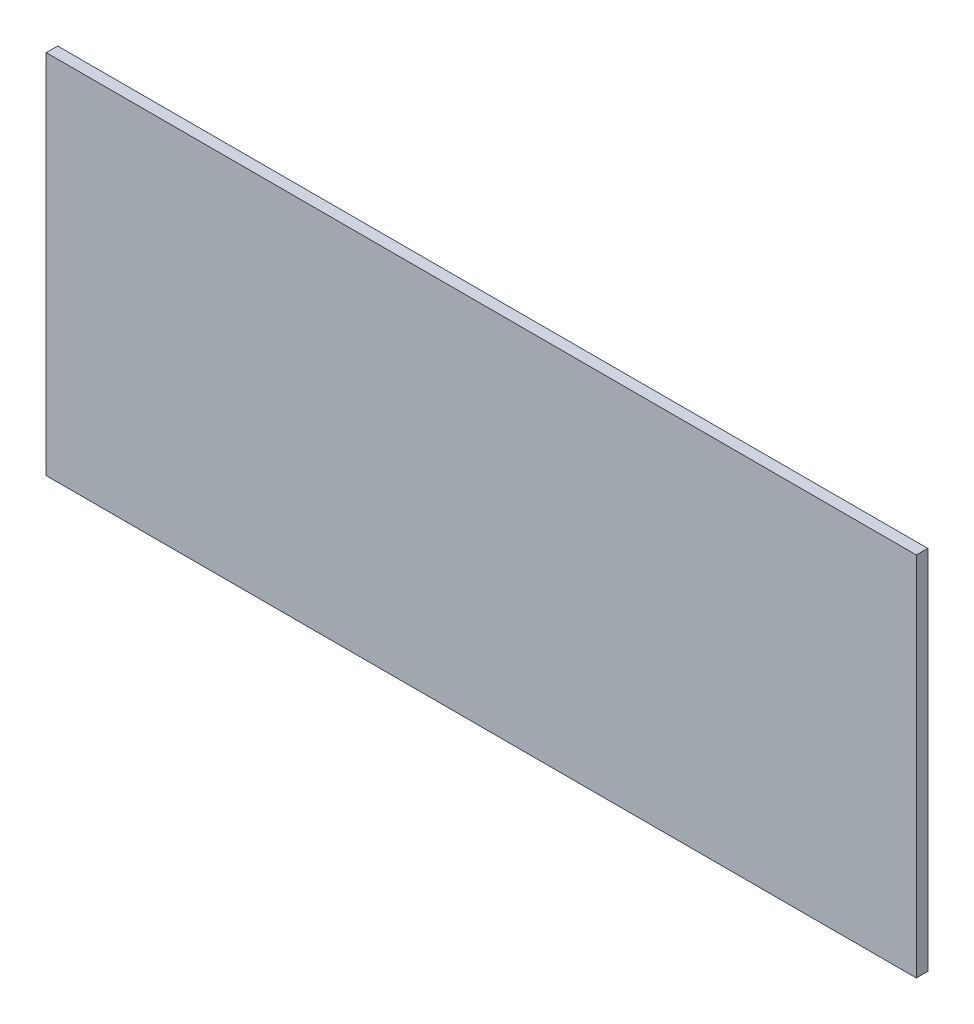
ISO-10303-21;
HEADER;
FILE_DESCRIPTION(('STEP AP214'),'2;1');
FILE_NAME('part.step','',(''),(''),'','','');
FILE_SCHEMA(('AUTOMOTIVE_DESIGN { 1 0 10303 214 1 1 1 1 }'));
ENDSEC;
DATA;
#1=APPLICATION_CONTEXT('core data for automotive mechanical design processes');
#2=APPLICATION_PROTOCOL_DEFINITION('international standard','automotive_design',2000,#1);
#3=PRODUCT_CONTEXT('',#1,'mechanical');
#4=PRODUCT('Part','Part','',(#3));
#5=PRODUCT_RELATED_PRODUCT_CATEGORY('part','',(#4));
#6=PRODUCT_DEFINITION_FORMATION('','',#4);
#7=PRODUCT_DEFINITION_CONTEXT('part definition',#1,'design');
#8=PRODUCT_DEFINITION('design','',#6,#7);
#9=PRODUCT_DEFINITION_SHAPE('','',#8);
#10=(LENGTH_UNIT() NAMED_UNIT(*) SI_UNIT(.MILLI.,.METRE.));
#11=(NAMED_UNIT(*) PLANE_ANGLE_UNIT() SI_UNIT($,.RADIAN.));
#12=(NAMED_UNIT(*) SI_UNIT($,.STERADIAN.) SOLID_ANGLE_UNIT());
#13=UNCERTAINTY_MEASURE_WITH_UNIT(LENGTH_MEASURE(1.E-05),#10,'distance_accuracy_value','');
#14=(GEOMETRIC_REPRESENTATION_CONTEXT(3) GLOBAL_UNCERTAINTY_ASSIGNED_CONTEXT((#13)) GLOBAL_UNIT_ASSIGNED_CONTEXT((#10,
#11,#12)) REPRESENTATION_CONTEXT('',''));
#15=CARTESIAN_POINT('',(0.,0.,0.));
#16=DIRECTION('',(0.,0.,1.));
#17=DIRECTION('',(1.,0.,0.));
#18=AXIS2_PLACEMENT_3D('',#15,#16,#17);
#19=CARTESIAN_POINT('',(0.,0.,1.58749999999985));
#20=DIRECTION('',(1.,0.,0.));
#21=DIRECTION('',(0.,0.,-1.));
#22=AXIS2_PLACEMENT_3D('',#19,#20,#21);
#23=PLANE('',#22);
#24=DIRECTION('',(0.,-1.,0.));
#25=VECTOR('',#24,1.);
#26=CARTESIAN_POINT('',(0.,0.,0.));
#27=LINE('',#26,#25);
#28=CARTESIAN_POINT('',(0.,50.8,4.44089209850063E-13));
#29=VERTEX_POINT('',#28);
#30=CARTESIAN_POINT('',(0.,0.,0.));
#31=VERTEX_POINT('',#30);
#32=EDGE_CURVE('E95',#29,#31,#27,.T.);
#33=ORIENTED_EDGE('',*,*,#32,.T.);
#34=DIRECTION('',(0.,0.,-1.));
#35=VECTOR('',#34,1.);
#36=CARTESIAN_POINT('',(0.,0.,1.58749999999985));
#37=LINE('',#36,#35);
#38=CARTESIAN_POINT('',(0.,0.,1.58749999999985));
#39=VERTEX_POINT('',#38);
#40=EDGE_CURVE('E11',#39,#31,#37,.T.);
#41=ORIENTED_EDGE('',*,*,#40,.F.);
#42=DIRECTION('',(0.,-1.,0.));
#43=VECTOR('',#42,1.);
#44=CARTESIAN_POINT('',(0.,0.,1.58749999999985));
#45=LINE('',#44,#43);
#46=CARTESIAN_POINT('',(0.,50.8,1.5875000000003));
#47=VERTEX_POINT('',#46);
#48=EDGE_CURVE('E83',#47,#39,#45,.T.);
#49=ORIENTED_EDGE('',*,*,#48,.F.);
#50=DIRECTION('',(0.,0.,-1.));
#51=VECTOR('',#50,1.);
#52=CARTESIAN_POINT('',(0.,50.8,1.5875000000003));
#53=LINE('',#52,#51);
#54=EDGE_CURVE('E91',#47,#29,#53,.T.);
#55=ORIENTED_EDGE('',*,*,#54,.T.);
#56=EDGE_LOOP('',(#33,#41,#49,#55));
#57=FACE_BOUND('',#56,.T.);
#58=ADVANCED_FACE('F32',(#57),#23,.F.);
#59=CARTESIAN_POINT('',(0.,0.,1.58749999999985));
#60=DIRECTION('',(0.,1.,0.));
#61=DIRECTION('',(0.,0.,1.));
#62=AXIS2_PLACEMENT_3D('',#59,#60,#61);
#63=PLANE('',#62);
#64=DIRECTION('',(1.,0.,0.));
#65=VECTOR('',#64,1.);
#66=CARTESIAN_POINT('',(0.,0.,0.));
#67=LINE('',#66,#65);
#68=CARTESIAN_POINT('',(120.65,0.,4.44089209850063E-13));
#69=VERTEX_POINT('',#68);
#70=EDGE_CURVE('E87',#31,#69,#67,.T.);
#71=ORIENTED_EDGE('',*,*,#70,.T.);
#72=DIRECTION('',(0.,0.,-1.));
#73=VECTOR('',#72,1.);
#74=CARTESIAN_POINT('',(120.65,0.,1.5875000000003));
#75=LINE('',#74,#73);
#76=CARTESIAN_POINT('',(120.65,0.,1.5875000000003));
#77=VERTEX_POINT('',#76);
#78=EDGE_CURVE('E40',#77,#69,#75,.T.);
#79=ORIENTED_EDGE('',*,*,#78,.F.);
#80=DIRECTION('',(1.,0.,0.));
#81=VECTOR('',#80,1.);
#82=CARTESIAN_POINT('',(0.,0.,1.58749999999985));
#83=LINE('',#82,#81);
#84=EDGE_CURVE('E78',#39,#77,#83,.T.);
#85=ORIENTED_EDGE('',*,*,#84,.F.);
#86=ORIENTED_EDGE('',*,*,#40,.T.);
#87=EDGE_LOOP('',(#71,#79,#85,#86));
#88=FACE_BOUND('',#87,.T.);
#89=ADVANCED_FACE('F86',(#88),#63,.F.);
#90=CARTESIAN_POINT('',(120.65,0.,1.5875000000003));
#91=DIRECTION('',(-1.,0.,0.));
#92=DIRECTION('',(0.,-1.,0.));
#93=AXIS2_PLACEMENT_3D('',#90,#91,#92);
#94=PLANE('',#93);
#95=DIRECTION('',(0.,1.,0.));
#96=VECTOR('',#95,1.);
#97=CARTESIAN_POINT('',(120.65,0.,4.44089209850063E-13));
#98=LINE('',#97,#96);
#99=CARTESIAN_POINT('',(120.65,50.8,4.44089209850063E-13));
#100=VERTEX_POINT('',#99);
#101=EDGE_CURVE('E65',#69,#100,#98,.T.);
#102=ORIENTED_EDGE('',*,*,#101,.T.);
#103=DIRECTION('',(0.,0.,-1.));
#104=VECTOR('',#103,1.);
#105=CARTESIAN_POINT('',(120.65,50.8,1.5875000000003));
#106=LINE('',#105,#104);
#107=CARTESIAN_POINT('',(120.65,50.8,1.5875000000003));
#108=VERTEX_POINT('',#107);
#109=EDGE_CURVE('E88',#108,#100,#106,.T.);
#110=ORIENTED_EDGE('',*,*,#109,.F.);
#111=DIRECTION('',(0.,1.,0.));
#112=VECTOR('',#111,1.);
#113=CARTESIAN_POINT('',(120.65,0.,1.5875000000003));
#114=LINE('',#113,#112);
#115=EDGE_CURVE('E81',#77,#108,#114,.T.);
#116=ORIENTED_EDGE('',*,*,#115,.F.);
#117=ORIENTED_EDGE('',*,*,#78,.T.);
#118=EDGE_LOOP('',(#102,#110,#116,#117));
#119=FACE_BOUND('',#118,.T.);
#120=ADVANCED_FACE('F89',(#119),#94,.F.);
#121=CARTESIAN_POINT('',(0.,50.8,1.5875000000003));
#122=DIRECTION('',(0.,-1.,0.));
#123=DIRECTION('',(0.,0.,-1.));
#124=AXIS2_PLACEMENT_3D('',#121,#122,#123);
#125=PLANE('',#124);
#126=DIRECTION('',(-1.,0.,0.));
#127=VECTOR('',#126,1.);
#128=CARTESIAN_POINT('',(0.,50.8,4.44089209850063E-13));
#129=LINE('',#128,#127);
#130=EDGE_CURVE('E71',#100,#29,#129,.T.);
#131=ORIENTED_EDGE('',*,*,#130,.T.);
#132=ORIENTED_EDGE('',*,*,#54,.F.);
#133=DIRECTION('',(-1.,0.,0.));
#134=VECTOR('',#133,1.);
#135=CARTESIAN_POINT('',(0.,50.8,1.5875000000003));
#136=LINE('',#135,#134);
#137=EDGE_CURVE('E48',#108,#47,#136,.T.);
#138=ORIENTED_EDGE('',*,*,#137,.F.);
#139=ORIENTED_EDGE('',*,*,#109,.T.);
#140=EDGE_LOOP('',(#131,#132,#138,#139));
#141=FACE_BOUND('',#140,.T.);
#142=ADVANCED_FACE('F102',(#141),#125,.F.);
#143=CARTESIAN_POINT('',(0.,0.,1.58749999999985));
#144=DIRECTION('',(0.,0.,-1.));
#145=DIRECTION('',(-1.,0.,0.));
#146=AXIS2_PLACEMENT_3D('',#143,#144,#145);
#147=PLANE('',#146);
#148=ORIENTED_EDGE('',*,*,#48,.T.);
#149=ORIENTED_EDGE('',*,*,#84,.T.);
#150=ORIENTED_EDGE('',*,*,#115,.T.);
#151=ORIENTED_EDGE('',*,*,#137,.T.);
#152=EDGE_LOOP('',(#148,#149,#150,#151));
#153=FACE_BOUND('',#152,.T.);
#154=ADVANCED_FACE('F79',(#153),#147,.F.);
#155=CARTESIAN_POINT('',(0.,0.,0.));
#156=DIRECTION('',(0.,0.,-1.));
#157=DIRECTION('',(-1.,0.,0.));
#158=AXIS2_PLACEMENT_3D('',#155,#156,#157);
#159=PLANE('',#158);
#160=ORIENTED_EDGE('',*,*,#32,.F.);
#161=ORIENTED_EDGE('',*,*,#130,.F.);
#162=ORIENTED_EDGE('',*,*,#101,.F.);
#163=ORIENTED_EDGE('',*,*,#70,.F.);
#164=EDGE_LOOP('',(#160,#161,#162,#163));
#165=FACE_BOUND('',#164,.T.);
#166=ADVANCED_FACE('F105',(#165),#159,.T.);
#167=CLOSED_SHELL('',(#58,#89,#120,#142,#154,#166));
#168=MANIFOLD_SOLID_BREP('B2',#167);
#169=ADVANCED_BREP_SHAPE_REPRESENTATION('',(#18,#168),#14);
#170=SHAPE_DEFINITION_REPRESENTATION(#9,#169);
ENDSEC;
END-ISO-10303-21;
